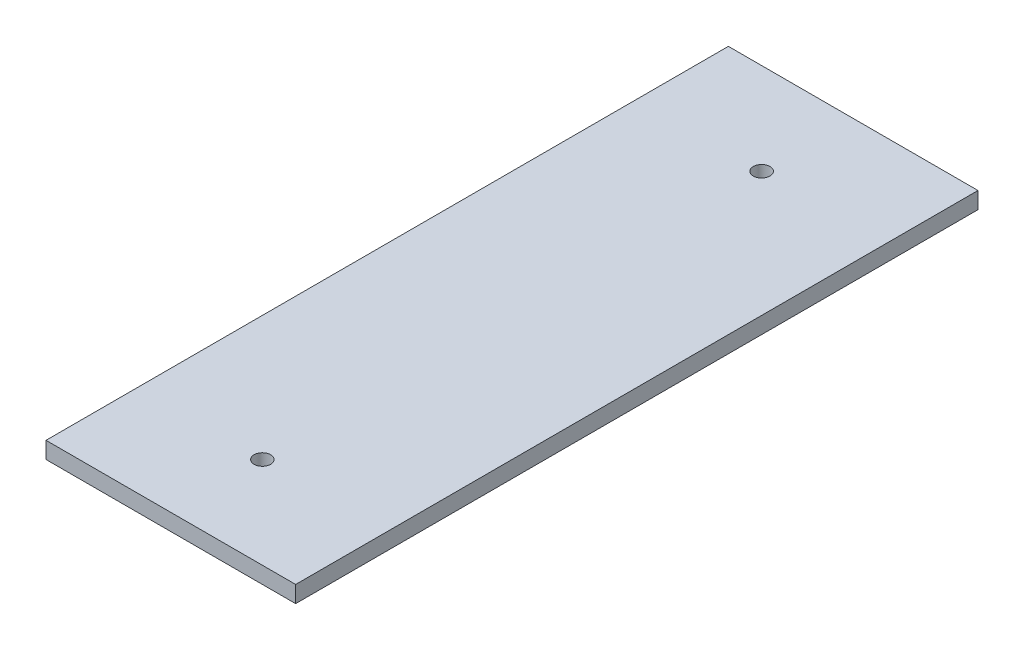
ISO-10303-21;
HEADER;
FILE_DESCRIPTION(('STEP AP214'),'2;1');
FILE_NAME('part.step','',(''),(''),'','','');
FILE_SCHEMA(('AUTOMOTIVE_DESIGN { 1 0 10303 214 1 1 1 1 }'));
ENDSEC;
DATA;
#1=APPLICATION_CONTEXT('core data for automotive mechanical design processes');
#2=APPLICATION_PROTOCOL_DEFINITION('international standard','automotive_design',2000,#1);
#3=PRODUCT_CONTEXT('',#1,'mechanical');
#4=PRODUCT('Part','Part','',(#3));
#5=PRODUCT_RELATED_PRODUCT_CATEGORY('part','',(#4));
#6=PRODUCT_DEFINITION_FORMATION('','',#4);
#7=PRODUCT_DEFINITION_CONTEXT('part definition',#1,'design');
#8=PRODUCT_DEFINITION('design','',#6,#7);
#9=PRODUCT_DEFINITION_SHAPE('','',#8);
#10=(LENGTH_UNIT() NAMED_UNIT(*) SI_UNIT(.MILLI.,.METRE.));
#11=(NAMED_UNIT(*) PLANE_ANGLE_UNIT() SI_UNIT($,.RADIAN.));
#12=(NAMED_UNIT(*) SI_UNIT($,.STERADIAN.) SOLID_ANGLE_UNIT());
#13=UNCERTAINTY_MEASURE_WITH_UNIT(LENGTH_MEASURE(1.E-05),#10,'distance_accuracy_value','');
#14=(GEOMETRIC_REPRESENTATION_CONTEXT(3) GLOBAL_UNCERTAINTY_ASSIGNED_CONTEXT((#13)) GLOBAL_UNIT_ASSIGNED_CONTEXT((#10,
#11,#12)) REPRESENTATION_CONTEXT('',''));
#15=CARTESIAN_POINT('',(0.,0.,0.));
#16=DIRECTION('',(0.,0.,1.));
#17=DIRECTION('',(1.,0.,0.));
#18=AXIS2_PLACEMENT_3D('',#15,#16,#17);
#19=CARTESIAN_POINT('',(0.,2.,0.));
#20=DIRECTION('',(1.,0.,0.));
#21=DIRECTION('',(0.,0.,-1.));
#22=AXIS2_PLACEMENT_3D('',#19,#20,#21);
#23=PLANE('',#22);
#24=DIRECTION('',(0.,0.,1.));
#25=VECTOR('',#24,1.);
#26=CARTESIAN_POINT('',(0.,0.,0.));
#27=LINE('',#26,#25);
#28=CARTESIAN_POINT('',(0.,0.,-82.));
#29=VERTEX_POINT('',#28);
#30=CARTESIAN_POINT('',(0.,0.,0.));
#31=VERTEX_POINT('',#30);
#32=EDGE_CURVE('E94',#29,#31,#27,.T.);
#33=ORIENTED_EDGE('',*,*,#32,.T.);
#34=DIRECTION('',(0.,-1.,0.));
#35=VECTOR('',#34,1.);
#36=CARTESIAN_POINT('',(0.,2.,0.));
#37=LINE('',#36,#35);
#38=CARTESIAN_POINT('',(0.,2.,0.));
#39=VERTEX_POINT('',#38);
#40=EDGE_CURVE('E11',#39,#31,#37,.T.);
#41=ORIENTED_EDGE('',*,*,#40,.F.);
#42=DIRECTION('',(0.,0.,1.));
#43=VECTOR('',#42,1.);
#44=CARTESIAN_POINT('',(0.,2.,0.));
#45=LINE('',#44,#43);
#46=CARTESIAN_POINT('',(0.,2.,-82.));
#47=VERTEX_POINT('',#46);
#48=EDGE_CURVE('E82',#47,#39,#45,.T.);
#49=ORIENTED_EDGE('',*,*,#48,.F.);
#50=DIRECTION('',(0.,-1.,0.));
#51=VECTOR('',#50,1.);
#52=CARTESIAN_POINT('',(0.,2.,-82.));
#53=LINE('',#52,#51);
#54=EDGE_CURVE('E90',#47,#29,#53,.T.);
#55=ORIENTED_EDGE('',*,*,#54,.T.);
#56=EDGE_LOOP('',(#33,#41,#49,#55));
#57=FACE_BOUND('',#56,.T.);
#58=ADVANCED_FACE('F31',(#57),#23,.F.);
#59=CARTESIAN_POINT('',(0.,2.,0.));
#60=DIRECTION('',(0.,0.,-1.));
#61=DIRECTION('',(-1.,0.,0.));
#62=AXIS2_PLACEMENT_3D('',#59,#60,#61);
#63=PLANE('',#62);
#64=DIRECTION('',(1.,0.,0.));
#65=VECTOR('',#64,1.);
#66=CARTESIAN_POINT('',(0.,0.,0.));
#67=LINE('',#66,#65);
#68=CARTESIAN_POINT('',(30.,0.,0.));
#69=VERTEX_POINT('',#68);
#70=EDGE_CURVE('E86',#31,#69,#67,.T.);
#71=ORIENTED_EDGE('',*,*,#70,.T.);
#72=DIRECTION('',(0.,-1.,0.));
#73=VECTOR('',#72,1.);
#74=CARTESIAN_POINT('',(30.,2.,0.));
#75=LINE('',#74,#73);
#76=CARTESIAN_POINT('',(30.,2.,0.));
#77=VERTEX_POINT('',#76);
#78=EDGE_CURVE('E39',#77,#69,#75,.T.);
#79=ORIENTED_EDGE('',*,*,#78,.F.);
#80=DIRECTION('',(1.,0.,0.));
#81=VECTOR('',#80,1.);
#82=CARTESIAN_POINT('',(0.,2.,0.));
#83=LINE('',#82,#81);
#84=EDGE_CURVE('E77',#39,#77,#83,.T.);
#85=ORIENTED_EDGE('',*,*,#84,.F.);
#86=ORIENTED_EDGE('',*,*,#40,.T.);
#87=EDGE_LOOP('',(#71,#79,#85,#86));
#88=FACE_BOUND('',#87,.T.);
#89=ADVANCED_FACE('F85',(#88),#63,.F.);
#90=CARTESIAN_POINT('',(30.,2.,0.));
#91=DIRECTION('',(-1.,0.,0.));
#92=DIRECTION('',(0.,0.,1.));
#93=AXIS2_PLACEMENT_3D('',#90,#91,#92);
#94=PLANE('',#93);
#95=DIRECTION('',(0.,0.,-1.));
#96=VECTOR('',#95,1.);
#97=CARTESIAN_POINT('',(30.,0.,0.));
#98=LINE('',#97,#96);
#99=CARTESIAN_POINT('',(30.,0.,-82.));
#100=VERTEX_POINT('',#99);
#101=EDGE_CURVE('E64',#69,#100,#98,.T.);
#102=ORIENTED_EDGE('',*,*,#101,.T.);
#103=DIRECTION('',(0.,-1.,0.));
#104=VECTOR('',#103,1.);
#105=CARTESIAN_POINT('',(30.,2.,-82.));
#106=LINE('',#105,#104);
#107=CARTESIAN_POINT('',(30.,2.,-82.));
#108=VERTEX_POINT('',#107);
#109=EDGE_CURVE('E87',#108,#100,#106,.T.);
#110=ORIENTED_EDGE('',*,*,#109,.F.);
#111=DIRECTION('',(0.,0.,-1.));
#112=VECTOR('',#111,1.);
#113=CARTESIAN_POINT('',(30.,2.,0.));
#114=LINE('',#113,#112);
#115=EDGE_CURVE('E80',#77,#108,#114,.T.);
#116=ORIENTED_EDGE('',*,*,#115,.F.);
#117=ORIENTED_EDGE('',*,*,#78,.T.);
#118=EDGE_LOOP('',(#102,#110,#116,#117));
#119=FACE_BOUND('',#118,.T.);
#120=ADVANCED_FACE('F88',(#119),#94,.F.);
#121=CARTESIAN_POINT('',(0.,2.,-82.));
#122=DIRECTION('',(0.,0.,1.));
#123=DIRECTION('',(1.,0.,0.));
#124=AXIS2_PLACEMENT_3D('',#121,#122,#123);
#125=PLANE('',#124);
#126=DIRECTION('',(-1.,0.,0.));
#127=VECTOR('',#126,1.);
#128=CARTESIAN_POINT('',(0.,0.,-82.));
#129=LINE('',#128,#127);
#130=EDGE_CURVE('E70',#100,#29,#129,.T.);
#131=ORIENTED_EDGE('',*,*,#130,.T.);
#132=ORIENTED_EDGE('',*,*,#54,.F.);
#133=DIRECTION('',(-1.,0.,0.));
#134=VECTOR('',#133,1.);
#135=CARTESIAN_POINT('',(0.,2.,-82.));
#136=LINE('',#135,#134);
#137=EDGE_CURVE('E47',#108,#47,#136,.T.);
#138=ORIENTED_EDGE('',*,*,#137,.F.);
#139=ORIENTED_EDGE('',*,*,#109,.T.);
#140=EDGE_LOOP('',(#131,#132,#138,#139));
#141=FACE_BOUND('',#140,.T.);
#142=ADVANCED_FACE('F102',(#141),#125,.F.);
#143=CARTESIAN_POINT('',(0.,2.,-82.));
#144=DIRECTION('',(0.,-1.,0.));
#145=DIRECTION('',(0.,0.,-1.));
#146=AXIS2_PLACEMENT_3D('',#143,#144,#145);
#147=PLANE('',#146);
#148=CARTESIAN_POINT('',(15.,2.,-11.));
#149=DIRECTION('',(0.,1.,0.));
#150=DIRECTION('',(0.,0.,-1.));
#151=AXIS2_PLACEMENT_3D('',#148,#149,#150);
#152=CIRCLE('',#151,0.999999999999998);
#153=CARTESIAN_POINT('',(15.,2.,-12.));
#154=VERTEX_POINT('',#153);
#155=EDGE_CURVE('E114',#154,#154,#152,.T.);
#156=ORIENTED_EDGE('',*,*,#155,.F.);
#157=EDGE_LOOP('',(#156));
#158=FACE_BOUND('',#157,.T.);
#159=CARTESIAN_POINT('',(15.,2.,-71.));
#160=DIRECTION('',(0.,1.,0.));
#161=DIRECTION('',(0.,0.,1.));
#162=AXIS2_PLACEMENT_3D('',#159,#160,#161);
#163=CIRCLE('',#162,0.999999999999998);
#164=CARTESIAN_POINT('',(15.,2.,-70.));
#165=VERTEX_POINT('',#164);
#166=EDGE_CURVE('E108',#165,#165,#163,.T.);
#167=ORIENTED_EDGE('',*,*,#166,.F.);
#168=EDGE_LOOP('',(#167));
#169=FACE_BOUND('',#168,.T.);
#170=ORIENTED_EDGE('',*,*,#48,.T.);
#171=ORIENTED_EDGE('',*,*,#84,.T.);
#172=ORIENTED_EDGE('',*,*,#115,.T.);
#173=ORIENTED_EDGE('',*,*,#137,.T.);
#174=EDGE_LOOP('',(#170,#171,#172,#173));
#175=FACE_BOUND('',#174,.T.);
#176=ADVANCED_FACE('F78',(#158,#169,#175),#147,.F.);
#177=CARTESIAN_POINT('',(0.,0.,-82.));
#178=DIRECTION('',(0.,-1.,0.));
#179=DIRECTION('',(0.,0.,-1.));
#180=AXIS2_PLACEMENT_3D('',#177,#178,#179);
#181=PLANE('',#180);
#182=CARTESIAN_POINT('',(15.,0.,-11.));
#183=DIRECTION('',(0.,1.,0.));
#184=DIRECTION('',(0.,0.,-1.));
#185=AXIS2_PLACEMENT_3D('',#182,#183,#184);
#186=CIRCLE('',#185,0.999999999999998);
#187=CARTESIAN_POINT('',(15.,0.,-12.));
#188=VERTEX_POINT('',#187);
#189=EDGE_CURVE('E111',#188,#188,#186,.T.);
#190=ORIENTED_EDGE('',*,*,#189,.T.);
#191=EDGE_LOOP('',(#190));
#192=FACE_BOUND('',#191,.T.);
#193=CARTESIAN_POINT('',(15.,0.,-71.));
#194=DIRECTION('',(0.,1.,0.));
#195=DIRECTION('',(0.,0.,1.));
#196=AXIS2_PLACEMENT_3D('',#193,#194,#195);
#197=CIRCLE('',#196,0.999999999999998);
#198=CARTESIAN_POINT('',(15.,0.,-70.));
#199=VERTEX_POINT('',#198);
#200=EDGE_CURVE('E97',#199,#199,#197,.T.);
#201=ORIENTED_EDGE('',*,*,#200,.T.);
#202=EDGE_LOOP('',(#201));
#203=FACE_BOUND('',#202,.T.);
#204=ORIENTED_EDGE('',*,*,#32,.F.);
#205=ORIENTED_EDGE('',*,*,#130,.F.);
#206=ORIENTED_EDGE('',*,*,#101,.F.);
#207=ORIENTED_EDGE('',*,*,#70,.F.);
#208=EDGE_LOOP('',(#204,#205,#206,#207));
#209=FACE_BOUND('',#208,.T.);
#210=ADVANCED_FACE('F105',(#192,#203,#209),#181,.T.);
#211=CARTESIAN_POINT('',(15.,0.,-71.));
#212=DIRECTION('',(0.,1.,0.));
#213=DIRECTION('',(0.,0.,1.));
#214=AXIS2_PLACEMENT_3D('',#211,#212,#213);
#215=CYLINDRICAL_SURFACE('',#214,0.999999999999998);
#216=ORIENTED_EDGE('',*,*,#200,.F.);
#217=EDGE_LOOP('',(#216));
#218=FACE_BOUND('',#217,.T.);
#219=ORIENTED_EDGE('',*,*,#166,.T.);
#220=EDGE_LOOP('',(#219));
#221=FACE_BOUND('',#220,.T.);
#222=ADVANCED_FACE('F125',(#218,#221),#215,.F.);
#223=CARTESIAN_POINT('',(15.,0.,-11.));
#224=DIRECTION('',(0.,1.,0.));
#225=DIRECTION('',(0.,0.,1.));
#226=AXIS2_PLACEMENT_3D('',#223,#224,#225);
#227=CYLINDRICAL_SURFACE('',#226,0.999999999999998);
#228=ORIENTED_EDGE('',*,*,#189,.F.);
#229=EDGE_LOOP('',(#228));
#230=FACE_BOUND('',#229,.T.);
#231=ORIENTED_EDGE('',*,*,#155,.T.);
#232=EDGE_LOOP('',(#231));
#233=FACE_BOUND('',#232,.T.);
#234=ADVANCED_FACE('F122',(#230,#233),#227,.F.);
#235=CLOSED_SHELL('',(#58,#89,#120,#142,#176,#210,#222,#234));
#236=MANIFOLD_SOLID_BREP('B2',#235);
#237=ADVANCED_BREP_SHAPE_REPRESENTATION('',(#18,#236),#14);
#238=SHAPE_DEFINITION_REPRESENTATION(#9,#237);
ENDSEC;
END-ISO-10303-21;
